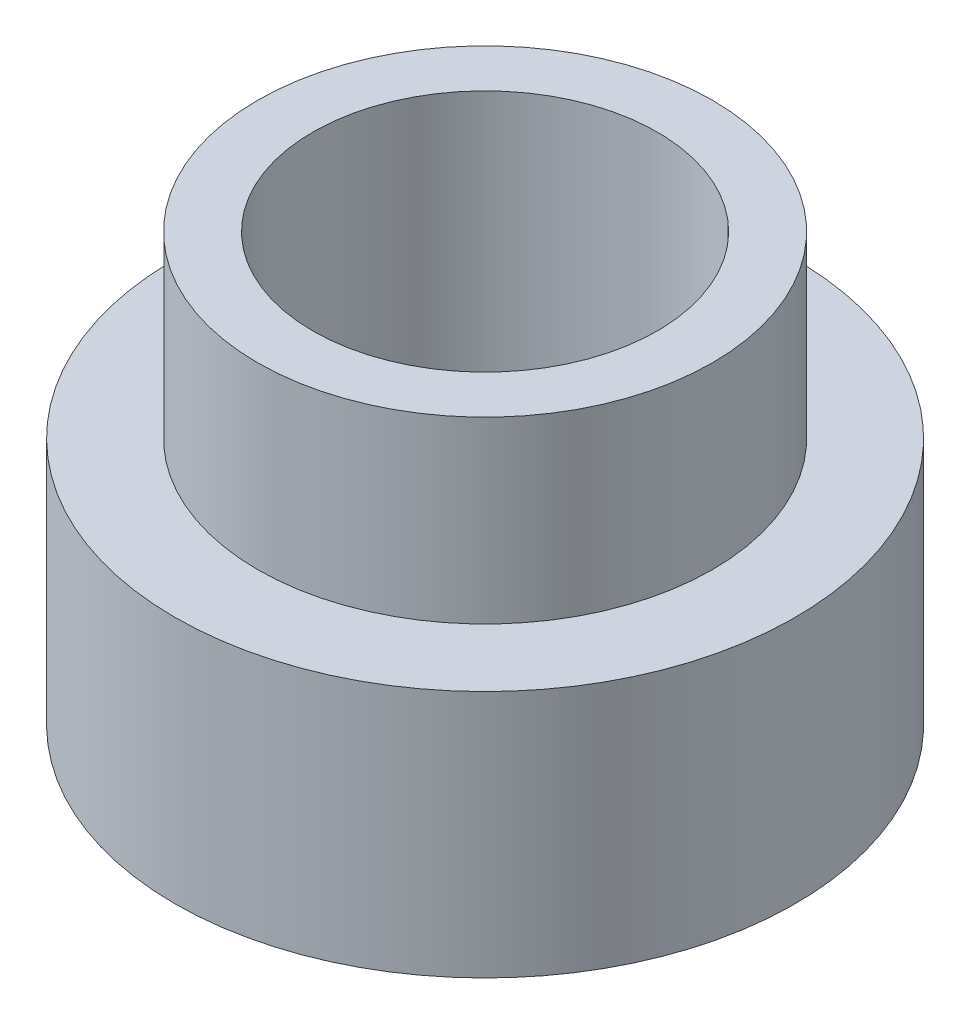
ISO-10303-21;
HEADER;
FILE_DESCRIPTION(('STEP AP214'),'2;1');
FILE_NAME('part.step','',(''),(''),'','','');
FILE_SCHEMA(('AUTOMOTIVE_DESIGN { 1 0 10303 214 1 1 1 1 }'));
ENDSEC;
DATA;
#1=APPLICATION_CONTEXT('core data for automotive mechanical design processes');
#2=APPLICATION_PROTOCOL_DEFINITION('international standard','automotive_design',2000,#1);
#3=PRODUCT_CONTEXT('',#1,'mechanical');
#4=PRODUCT('Part','Part','',(#3));
#5=PRODUCT_RELATED_PRODUCT_CATEGORY('part','',(#4));
#6=PRODUCT_DEFINITION_FORMATION('','',#4);
#7=PRODUCT_DEFINITION_CONTEXT('part definition',#1,'design');
#8=PRODUCT_DEFINITION('design','',#6,#7);
#9=PRODUCT_DEFINITION_SHAPE('','',#8);
#10=(LENGTH_UNIT() NAMED_UNIT(*) SI_UNIT(.MILLI.,.METRE.));
#11=(NAMED_UNIT(*) PLANE_ANGLE_UNIT() SI_UNIT($,.RADIAN.));
#12=(NAMED_UNIT(*) SI_UNIT($,.STERADIAN.) SOLID_ANGLE_UNIT());
#13=UNCERTAINTY_MEASURE_WITH_UNIT(LENGTH_MEASURE(1.E-05),#10,'distance_accuracy_value','');
#14=(GEOMETRIC_REPRESENTATION_CONTEXT(3) GLOBAL_UNCERTAINTY_ASSIGNED_CONTEXT((#13)) GLOBAL_UNIT_ASSIGNED_CONTEXT((#10,
#11,#12)) REPRESENTATION_CONTEXT('',''));
#15=CARTESIAN_POINT('',(0.,0.,0.));
#16=DIRECTION('',(0.,0.,1.));
#17=DIRECTION('',(1.,0.,0.));
#18=AXIS2_PLACEMENT_3D('',#15,#16,#17);
#19=CARTESIAN_POINT('',(0.,3.1,0.));
#20=DIRECTION('',(0.,-1.,0.));
#21=DIRECTION('',(0.,0.,-1.));
#22=AXIS2_PLACEMENT_3D('',#19,#20,#21);
#23=CYLINDRICAL_SURFACE('',#22,2.25);
#24=CARTESIAN_POINT('',(0.,0.,0.));
#25=DIRECTION('',(0.,1.,0.));
#26=DIRECTION('',(0.,0.,1.));
#27=AXIS2_PLACEMENT_3D('',#24,#25,#26);
#28=CIRCLE('',#27,2.25);
#29=CARTESIAN_POINT('',(0.,0.,2.25));
#30=VERTEX_POINT('',#29);
#31=EDGE_CURVE('E11',#30,#30,#28,.T.);
#32=ORIENTED_EDGE('',*,*,#31,.T.);
#33=EDGE_LOOP('',(#32));
#34=FACE_BOUND('',#33,.T.);
#35=CARTESIAN_POINT('',(0.,1.8,0.));
#36=DIRECTION('',(0.,1.,0.));
#37=DIRECTION('',(0.,0.,1.));
#38=AXIS2_PLACEMENT_3D('',#35,#36,#37);
#39=CIRCLE('',#38,2.25);
#40=CARTESIAN_POINT('',(0.,1.8,2.25));
#41=VERTEX_POINT('',#40);
#42=EDGE_CURVE('E36',#41,#41,#39,.T.);
#43=ORIENTED_EDGE('',*,*,#42,.F.);
#44=EDGE_LOOP('',(#43));
#45=FACE_BOUND('',#44,.T.);
#46=ADVANCED_FACE('F33',(#34,#45),#23,.T.);
#47=CARTESIAN_POINT('',(0.,0.,0.));
#48=DIRECTION('',(0.,1.,0.));
#49=DIRECTION('',(0.,0.,1.));
#50=AXIS2_PLACEMENT_3D('',#47,#48,#49);
#51=PLANE('',#50);
#52=CARTESIAN_POINT('',(0.,0.,0.));
#53=DIRECTION('',(0.,1.,0.));
#54=DIRECTION('',(0.,0.,1.));
#55=AXIS2_PLACEMENT_3D('',#52,#53,#54);
#56=CIRCLE('',#55,1.25);
#57=CARTESIAN_POINT('',(0.,0.,1.25));
#58=VERTEX_POINT('',#57);
#59=EDGE_CURVE('E48',#58,#58,#56,.T.);
#60=ORIENTED_EDGE('',*,*,#59,.T.);
#61=EDGE_LOOP('',(#60));
#62=FACE_BOUND('',#61,.T.);
#63=ORIENTED_EDGE('',*,*,#31,.F.);
#64=EDGE_LOOP('',(#63));
#65=FACE_BOUND('',#64,.T.);
#66=ADVANCED_FACE('F57',(#62,#65),#51,.F.);
#67=CARTESIAN_POINT('',(0.,1.8,0.));
#68=DIRECTION('',(0.,1.,0.));
#69=DIRECTION('',(0.,0.,1.));
#70=AXIS2_PLACEMENT_3D('',#67,#68,#69);
#71=PLANE('',#70);
#72=CARTESIAN_POINT('',(0.,1.8,0.));
#73=DIRECTION('',(0.,1.,0.));
#74=DIRECTION('',(0.,0.,1.));
#75=AXIS2_PLACEMENT_3D('',#72,#73,#74);
#76=CIRCLE('',#75,1.65);
#77=CARTESIAN_POINT('',(0.,1.8,1.65));
#78=VERTEX_POINT('',#77);
#79=EDGE_CURVE('E43',#78,#78,#76,.T.);
#80=ORIENTED_EDGE('',*,*,#79,.F.);
#81=EDGE_LOOP('',(#80));
#82=FACE_BOUND('',#81,.T.);
#83=ORIENTED_EDGE('',*,*,#42,.T.);
#84=EDGE_LOOP('',(#83));
#85=FACE_BOUND('',#84,.T.);
#86=ADVANCED_FACE('F74',(#82,#85),#71,.T.);
#87=CARTESIAN_POINT('',(0.,1.8,0.));
#88=DIRECTION('',(0.,1.,0.));
#89=DIRECTION('',(0.,0.,1.));
#90=AXIS2_PLACEMENT_3D('',#87,#88,#89);
#91=CYLINDRICAL_SURFACE('',#90,1.65);
#92=ORIENTED_EDGE('',*,*,#79,.T.);
#93=EDGE_LOOP('',(#92));
#94=FACE_BOUND('',#93,.T.);
#95=CARTESIAN_POINT('',(0.,3.1,0.));
#96=DIRECTION('',(0.,1.,0.));
#97=DIRECTION('',(0.,0.,1.));
#98=AXIS2_PLACEMENT_3D('',#95,#96,#97);
#99=CIRCLE('',#98,1.65);
#100=CARTESIAN_POINT('',(0.,3.1,1.65));
#101=VERTEX_POINT('',#100);
#102=EDGE_CURVE('E45',#101,#101,#99,.T.);
#103=ORIENTED_EDGE('',*,*,#102,.F.);
#104=EDGE_LOOP('',(#103));
#105=FACE_BOUND('',#104,.T.);
#106=ADVANCED_FACE('F69',(#94,#105),#91,.T.);
#107=CARTESIAN_POINT('',(0.,3.1,0.));
#108=DIRECTION('',(0.,1.,0.));
#109=DIRECTION('',(0.,0.,1.));
#110=AXIS2_PLACEMENT_3D('',#107,#108,#109);
#111=PLANE('',#110);
#112=CARTESIAN_POINT('',(0.,3.1,0.));
#113=DIRECTION('',(0.,1.,0.));
#114=DIRECTION('',(0.,0.,1.));
#115=AXIS2_PLACEMENT_3D('',#112,#113,#114);
#116=CIRCLE('',#115,1.25);
#117=CARTESIAN_POINT('',(0.,3.1,1.25));
#118=VERTEX_POINT('',#117);
#119=EDGE_CURVE('E51',#118,#118,#116,.T.);
#120=ORIENTED_EDGE('',*,*,#119,.F.);
#121=EDGE_LOOP('',(#120));
#122=FACE_BOUND('',#121,.T.);
#123=ORIENTED_EDGE('',*,*,#102,.T.);
#124=EDGE_LOOP('',(#123));
#125=FACE_BOUND('',#124,.T.);
#126=ADVANCED_FACE('F63',(#122,#125),#111,.T.);
#127=CARTESIAN_POINT('',(0.,0.,0.));
#128=DIRECTION('',(0.,1.,0.));
#129=DIRECTION('',(0.,0.,1.));
#130=AXIS2_PLACEMENT_3D('',#127,#128,#129);
#131=CYLINDRICAL_SURFACE('',#130,1.25);
#132=ORIENTED_EDGE('',*,*,#59,.F.);
#133=EDGE_LOOP('',(#132));
#134=FACE_BOUND('',#133,.T.);
#135=ORIENTED_EDGE('',*,*,#119,.T.);
#136=EDGE_LOOP('',(#135));
#137=FACE_BOUND('',#136,.T.);
#138=ADVANCED_FACE('F60',(#134,#137),#131,.F.);
#139=CLOSED_SHELL('',(#46,#66,#86,#106,#126,#138));
#140=MANIFOLD_SOLID_BREP('B2',#139);
#141=ADVANCED_BREP_SHAPE_REPRESENTATION('',(#18,#140),#14);
#142=SHAPE_DEFINITION_REPRESENTATION(#9,#141);
ENDSEC;
END-ISO-10303-21;
